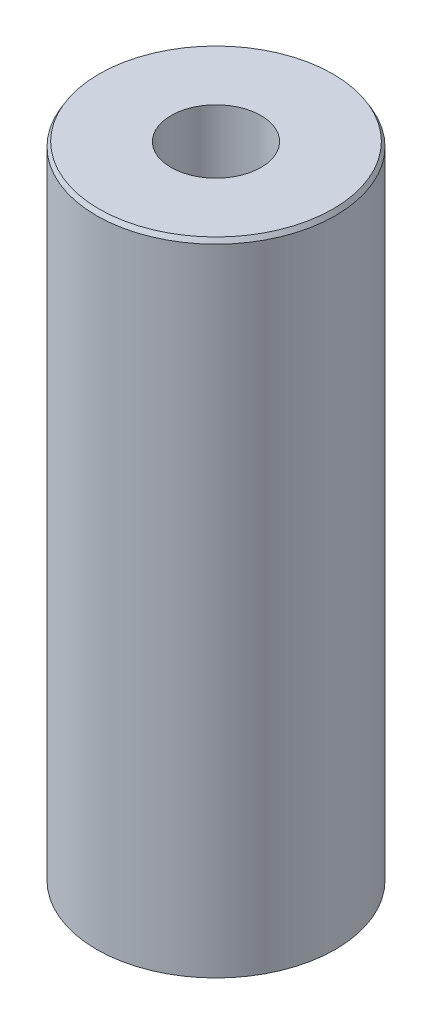
ISO-10303-21;
HEADER;
FILE_DESCRIPTION(('STEP AP214'),'2;1');
FILE_NAME('part.step','',(''),(''),'','','');
FILE_SCHEMA(('AUTOMOTIVE_DESIGN { 1 0 10303 214 1 1 1 1 }'));
ENDSEC;
DATA;
#1=APPLICATION_CONTEXT('core data for automotive mechanical design processes');
#2=APPLICATION_PROTOCOL_DEFINITION('international standard','automotive_design',2000,#1);
#3=PRODUCT_CONTEXT('',#1,'mechanical');
#4=PRODUCT('Part','Part','',(#3));
#5=PRODUCT_RELATED_PRODUCT_CATEGORY('part','',(#4));
#6=PRODUCT_DEFINITION_FORMATION('','',#4);
#7=PRODUCT_DEFINITION_CONTEXT('part definition',#1,'design');
#8=PRODUCT_DEFINITION('design','',#6,#7);
#9=PRODUCT_DEFINITION_SHAPE('','',#8);
#10=(LENGTH_UNIT() NAMED_UNIT(*) SI_UNIT(.MILLI.,.METRE.));
#11=(NAMED_UNIT(*) PLANE_ANGLE_UNIT() SI_UNIT($,.RADIAN.));
#12=(NAMED_UNIT(*) SI_UNIT($,.STERADIAN.) SOLID_ANGLE_UNIT());
#13=UNCERTAINTY_MEASURE_WITH_UNIT(LENGTH_MEASURE(1.E-05),#10,'distance_accuracy_value','');
#14=(GEOMETRIC_REPRESENTATION_CONTEXT(3) GLOBAL_UNCERTAINTY_ASSIGNED_CONTEXT((#13)) GLOBAL_UNIT_ASSIGNED_CONTEXT((#10,
#11,#12)) REPRESENTATION_CONTEXT('',''));
#15=CARTESIAN_POINT('',(0.,0.,0.));
#16=DIRECTION('',(0.,0.,1.));
#17=DIRECTION('',(1.,0.,0.));
#18=AXIS2_PLACEMENT_3D('',#15,#16,#17);
#19=CARTESIAN_POINT('',(0.,255.362633630855,0.));
#20=DIRECTION('',(0.,-1.,0.));
#21=DIRECTION('',(0.,0.,-1.));
#22=AXIS2_PLACEMENT_3D('',#19,#20,#21);
#23=CYLINDRICAL_SURFACE('',#22,47.5);
#24=CARTESIAN_POINT('',(0.,253.592754039187,0.));
#25=DIRECTION('',(0.,1.,0.));
#26=DIRECTION('',(0.,0.,1.));
#27=AXIS2_PLACEMENT_3D('',#24,#25,#26);
#28=CIRCLE('',#27,47.5);
#29=CARTESIAN_POINT('',(0.,253.592754039187,-47.5));
#30=VERTEX_POINT('',#29);
#31=EDGE_CURVE('E50',#30,#30,#28,.F.);
#32=ORIENTED_EDGE('',*,*,#31,.T.);
#33=EDGE_LOOP('',(#32));
#34=FACE_BOUND('',#33,.T.);
#35=CARTESIAN_POINT('',(0.,1.01511213781247,0.));
#36=DIRECTION('',(0.,1.,0.));
#37=DIRECTION('',(0.,0.,1.));
#38=AXIS2_PLACEMENT_3D('',#35,#36,#37);
#39=CIRCLE('',#38,47.5);
#40=CARTESIAN_POINT('',(0.,1.01511213781247,47.5));
#41=VERTEX_POINT('',#40);
#42=EDGE_CURVE('E51',#41,#41,#39,.T.);
#43=ORIENTED_EDGE('',*,*,#42,.T.);
#44=EDGE_LOOP('',(#43));
#45=FACE_BOUND('',#44,.T.);
#46=ADVANCED_FACE('F39',(#34,#45),#23,.T.);
#47=CARTESIAN_POINT('',(0.,255.362633630855,0.));
#48=DIRECTION('',(0.,1.,0.));
#49=DIRECTION('',(0.,0.,1.));
#50=AXIS2_PLACEMENT_3D('',#47,#48,#49);
#51=PLANE('',#50);
#52=CARTESIAN_POINT('',(0.,255.362633630855,0.));
#53=DIRECTION('',(0.,1.,0.));
#54=DIRECTION('',(0.,0.,1.));
#55=AXIS2_PLACEMENT_3D('',#52,#53,#54);
#56=CIRCLE('',#55,46.4848878621875);
#57=CARTESIAN_POINT('',(0.,255.362633630855,-46.4848878621876));
#58=VERTEX_POINT('',#57);
#59=EDGE_CURVE('E54',#58,#58,#56,.T.);
#60=ORIENTED_EDGE('',*,*,#59,.T.);
#61=EDGE_LOOP('',(#60));
#62=FACE_BOUND('',#61,.T.);
#63=CARTESIAN_POINT('',(0.,255.362633630855,0.));
#64=DIRECTION('',(0.,1.,0.));
#65=DIRECTION('',(0.,0.,1.));
#66=AXIS2_PLACEMENT_3D('',#63,#64,#65);
#67=CIRCLE('',#66,17.8825105185479);
#68=CARTESIAN_POINT('',(0.,255.362633630855,17.8825105185479));
#69=VERTEX_POINT('',#68);
#70=EDGE_CURVE('E58',#69,#69,#67,.T.);
#71=ORIENTED_EDGE('',*,*,#70,.F.);
#72=EDGE_LOOP('',(#71));
#73=FACE_BOUND('',#72,.T.);
#74=ADVANCED_FACE('F69',(#62,#73),#51,.T.);
#75=CARTESIAN_POINT('',(0.,0.,0.));
#76=DIRECTION('',(0.,1.,0.));
#77=DIRECTION('',(0.,0.,1.));
#78=AXIS2_PLACEMENT_3D('',#75,#76,#77);
#79=PLANE('',#78);
#80=CARTESIAN_POINT('',(0.,0.,0.));
#81=DIRECTION('',(0.,1.,0.));
#82=DIRECTION('',(0.,0.,1.));
#83=AXIS2_PLACEMENT_3D('',#80,#81,#82);
#84=CIRCLE('',#83,45.7301204083314);
#85=CARTESIAN_POINT('',(0.,0.,45.7301204083314));
#86=VERTEX_POINT('',#85);
#87=EDGE_CURVE('E10',#86,#86,#84,.F.);
#88=ORIENTED_EDGE('',*,*,#87,.T.);
#89=EDGE_LOOP('',(#88));
#90=FACE_BOUND('',#89,.T.);
#91=CARTESIAN_POINT('',(0.,0.,0.));
#92=DIRECTION('',(0.,1.,0.));
#93=DIRECTION('',(0.,0.,1.));
#94=AXIS2_PLACEMENT_3D('',#91,#92,#93);
#95=CIRCLE('',#94,17.8825105185479);
#96=CARTESIAN_POINT('',(0.,0.,17.8825105185479));
#97=VERTEX_POINT('',#96);
#98=EDGE_CURVE('E63',#97,#97,#95,.T.);
#99=ORIENTED_EDGE('',*,*,#98,.T.);
#100=EDGE_LOOP('',(#99));
#101=FACE_BOUND('',#100,.T.);
#102=ADVANCED_FACE('F75',(#90,#101),#79,.F.);
#103=CARTESIAN_POINT('',(0.,255.362633630855,0.));
#104=DIRECTION('',(0.,-1.,0.));
#105=DIRECTION('',(0.,0.,-1.));
#106=AXIS2_PLACEMENT_3D('',#103,#104,#105);
#107=CYLINDRICAL_SURFACE('',#106,17.8825105185479);
#108=ORIENTED_EDGE('',*,*,#70,.T.);
#109=EDGE_LOOP('',(#108));
#110=FACE_BOUND('',#109,.T.);
#111=ORIENTED_EDGE('',*,*,#98,.F.);
#112=EDGE_LOOP('',(#111));
#113=FACE_BOUND('',#112,.T.);
#114=ADVANCED_FACE('F70',(#110,#113),#107,.F.);
#115=CARTESIAN_POINT('',(0.,255.362633630855,0.));
#116=DIRECTION('',(0.,-1.,0.));
#117=DIRECTION('',(0.,0.,-1.));
#118=AXIS2_PLACEMENT_3D('',#115,#116,#117);
#119=CONICAL_SURFACE('',#118,46.4848878621875,0.520742904843116);
#120=CARTESIAN_POINT('',(0.,253.592754039187,-47.5));
#121=CARTESIAN_POINT('',(0.,253.611190284933,-47.4894259152311));
#122=CARTESIAN_POINT('',(0.,253.62962653068,-47.4788518304623));
#123=CARTESIAN_POINT('',(0.,253.666499022173,-47.4577036609245));
#124=CARTESIAN_POINT('',(0.,253.684935267919,-47.4471295761556));
#125=CARTESIAN_POINT('',(0.,253.721807759412,-47.4259814066179));
#126=CARTESIAN_POINT('',(0.,253.740244005159,-47.415407321849));
#127=CARTESIAN_POINT('',(0.,253.777116496652,-47.3942591523112));
#128=CARTESIAN_POINT('',(0.,253.795552742399,-47.3836850675423));
#129=CARTESIAN_POINT('',(0.,253.832425233892,-47.3625368980046));
#130=CARTESIAN_POINT('',(0.,253.850861479638,-47.3519628132357));
#131=CARTESIAN_POINT('',(0.,253.887733971131,-47.330814643698));
#132=CARTESIAN_POINT('',(0.,253.906170216878,-47.3202405589291));
#133=CARTESIAN_POINT('',(0.,253.943042708371,-47.2990923893913));
#134=CARTESIAN_POINT('',(0.,253.961478954118,-47.2885183046224));
#135=CARTESIAN_POINT('',(0.,253.998351445611,-47.2673701350847));
#136=CARTESIAN_POINT('',(0.,254.016787691357,-47.2567960503158));
#137=CARTESIAN_POINT('',(0.,254.05366018285,-47.235647880778));
#138=CARTESIAN_POINT('',(0.,254.072096428597,-47.2250737960091));
#139=CARTESIAN_POINT('',(0.,254.10896892009,-47.2039256264714));
#140=CARTESIAN_POINT('',(0.,254.127405165837,-47.1933515417025));
#141=CARTESIAN_POINT('',(0.,254.16427765733,-47.1722033721648));
#142=CARTESIAN_POINT('',(0.,254.182713903076,-47.1616292873959));
#143=CARTESIAN_POINT('',(0.,254.219586394569,-47.1404811178581));
#144=CARTESIAN_POINT('',(0.,254.238022640316,-47.1299070330892));
#145=CARTESIAN_POINT('',(0.,254.274895131809,-47.1087588635515));
#146=CARTESIAN_POINT('',(0.,254.293331377555,-47.0981847787826));
#147=CARTESIAN_POINT('',(0.,254.330203869049,-47.0770366092448));
#148=CARTESIAN_POINT('',(0.,254.348640114795,-47.066462524476));
#149=CARTESIAN_POINT('',(0.,254.385512606288,-47.0453143549382));
#150=CARTESIAN_POINT('',(0.,254.403948852035,-47.0347402701693));
#151=CARTESIAN_POINT('',(0.,254.440821343528,-47.0135921006315));
#152=CARTESIAN_POINT('',(0.,254.459257589274,-47.0030180158627));
#153=CARTESIAN_POINT('',(0.,254.496130080768,-46.9818698463249));
#154=CARTESIAN_POINT('',(0.,254.514566326514,-46.971295761556));
#155=CARTESIAN_POINT('',(0.,254.551438818007,-46.9501475920183));
#156=CARTESIAN_POINT('',(0.,254.569875063754,-46.9395735072494));
#157=CARTESIAN_POINT('',(0.,254.606747555247,-46.9184253377116));
#158=CARTESIAN_POINT('',(0.,254.625183800993,-46.9078512529428));
#159=CARTESIAN_POINT('',(0.,254.662056292486,-46.886703083405));
#160=CARTESIAN_POINT('',(0.,254.680492538233,-46.8761289986361));
#161=CARTESIAN_POINT('',(0.,254.717365029726,-46.8549808290984));
#162=CARTESIAN_POINT('',(0.,254.735801275473,-46.8444067443295));
#163=CARTESIAN_POINT('',(0.,254.772673766966,-46.8232585747917));
#164=CARTESIAN_POINT('',(0.,254.791110012712,-46.8126844900228));
#165=CARTESIAN_POINT('',(0.,254.827982504205,-46.7915363204851));
#166=CARTESIAN_POINT('',(0.,254.846418749952,-46.7809622357162));
#167=CARTESIAN_POINT('',(0.,254.883291241445,-46.7598140661784));
#168=CARTESIAN_POINT('',(0.,254.901727487192,-46.7492399814096));
#169=CARTESIAN_POINT('',(0.,254.938599978685,-46.7280918118718));
#170=CARTESIAN_POINT('',(0.,254.957036224431,-46.7175177271029));
#171=CARTESIAN_POINT('',(0.,254.993908715924,-46.6963695575652));
#172=CARTESIAN_POINT('',(0.,255.012344961671,-46.6857954727963));
#173=CARTESIAN_POINT('',(0.,255.049217453164,-46.6646473032585));
#174=CARTESIAN_POINT('',(0.,255.06765369891,-46.6540732184896));
#175=CARTESIAN_POINT('',(0.,255.104526190404,-46.6329250489519));
#176=CARTESIAN_POINT('',(0.,255.12296243615,-46.622350964183));
#177=CARTESIAN_POINT('',(0.,255.159834927643,-46.6012027946452));
#178=CARTESIAN_POINT('',(0.,255.17827117339,-46.5906287098764));
#179=CARTESIAN_POINT('',(0.,255.215143664883,-46.5694805403386));
#180=CARTESIAN_POINT('',(0.,255.233579910629,-46.5589064555697));
#181=CARTESIAN_POINT('',(0.,255.270452402123,-46.537758286032));
#182=CARTESIAN_POINT('',(0.,255.288888647869,-46.5271842012631));
#183=CARTESIAN_POINT('',(0.,255.325761139362,-46.5060360317253));
#184=CARTESIAN_POINT('',(0.,255.344197385109,-46.4954619469564));
#185=CARTESIAN_POINT('',(0.,255.362633630855,-46.4848878621876));
#186=B_SPLINE_CURVE_WITH_KNOTS('',3,(#120,#121,#122,#123,#124,#125,#126,#127,#128,#129,#130,
#131,#132,#133,#134,#135,#136,#137,#138,#139,#140,#141,#142,#143,#144,#145,#146,#147,#148,#149,
#150,#151,#152,#153,#154,#155,#156,#157,#158,#159,#160,#161,#162,#163,#164,#165,#166,#167,#168,
#169,#170,#171,#172,#173,#174,#175,#176,#177,#178,#179,#180,#181,#182,#183,#184,#185),
.UNSPECIFIED.,.F.,.F.,(4,2,2,2,2,2,2,2,2,2,2,2,2,2,2,2,2,2,2,2,2,2,2,2,2,2,2,2,2,2,2,2,4),(0.,
0.0637601586677591,0.127520317335522,0.191280476003281,0.255040634671043,0.31880079333885,
0.382560952006613,0.446321110674372,0.510081269342131,0.573841428009894,0.637601586677701,
0.701361745345464,0.765121904013223,0.828882062680985,0.892642221348793,0.956402380016555,
1.02016253868431,1.08392269735208,1.14768285601984,1.21144301468765,1.27520317335541,
1.33896333202317,1.40272349069093,1.46648364935873,1.5302438080265,1.59400396669426,
1.65776412536202,1.72152428402978,1.78528444269759,1.84904460136535,1.91280476003311,
1.97656491870087,2.04032507736868),.UNSPECIFIED.);
#187=EDGE_CURVE('BSEAM81',#30,#58,#186,.T.);
#188=ORIENTED_EDGE('',*,*,#31,.F.);
#189=ORIENTED_EDGE('',*,*,#59,.F.);
#190=ORIENTED_EDGE('',*,*,#187,.T.);
#191=ORIENTED_EDGE('',*,*,#187,.F.);
#192=EDGE_LOOP('',(#188,#190,#189,#191));
#193=FACE_BOUND('',#192,.T.);
#194=ADVANCED_FACE('F81',(#193),#119,.T.);
#195=CARTESIAN_POINT('',(0.,1.01511213781247,0.));
#196=DIRECTION('',(0.,1.,0.));
#197=DIRECTION('',(0.,0.,1.));
#198=AXIS2_PLACEMENT_3D('',#195,#196,#197);
#199=CONICAL_SURFACE('',#198,47.5,1.05005342195177);
#200=ORIENTED_EDGE('',*,*,#87,.F.);
#201=EDGE_LOOP('',(#200));
#202=FACE_BOUND('',#201,.T.);
#203=ORIENTED_EDGE('',*,*,#42,.F.);
#204=EDGE_LOOP('',(#203));
#205=FACE_BOUND('',#204,.T.);
#206=ADVANCED_FACE('F45',(#202,#205),#199,.T.);
#207=CLOSED_SHELL('',(#46,#74,#102,#114,#194,#206));
#208=MANIFOLD_SOLID_BREP('B2',#207);
#209=ADVANCED_BREP_SHAPE_REPRESENTATION('',(#18,#208),#14);
#210=SHAPE_DEFINITION_REPRESENTATION(#9,#209);
ENDSEC;
END-ISO-10303-21;
